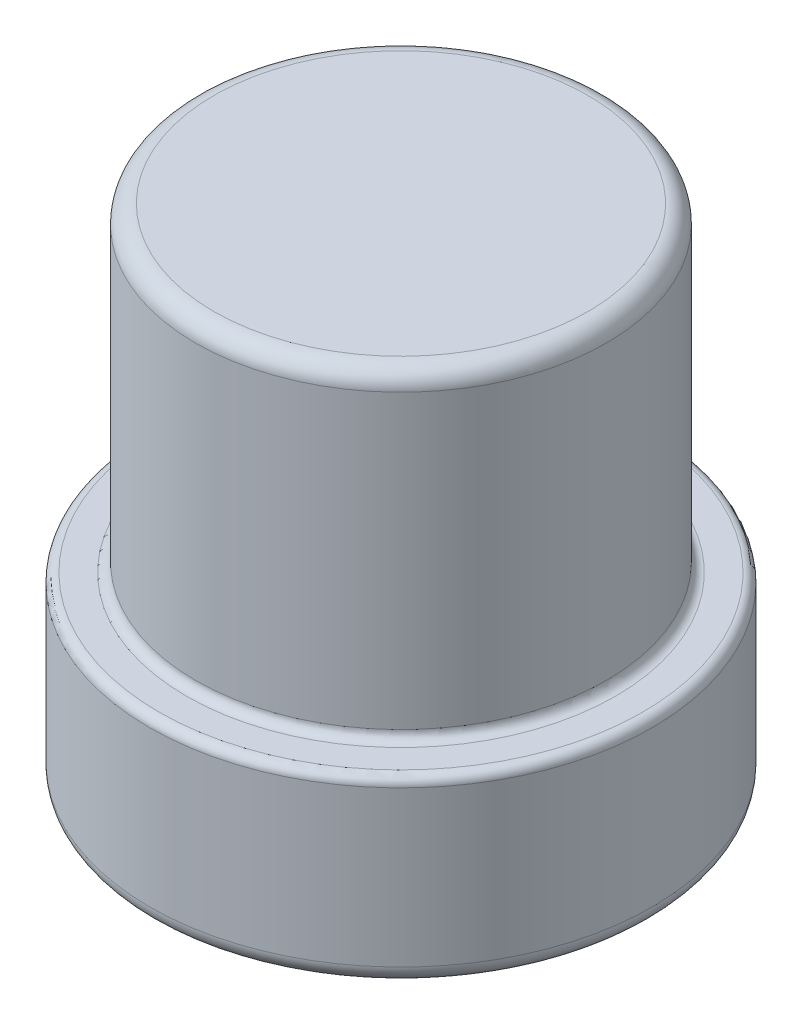
ISO-10303-21;
HEADER;
FILE_DESCRIPTION(('STEP AP214'),'2;1');
FILE_NAME('part.step','',(''),(''),'','','');
FILE_SCHEMA(('AUTOMOTIVE_DESIGN { 1 0 10303 214 1 1 1 1 }'));
ENDSEC;
DATA;
#1=APPLICATION_CONTEXT('core data for automotive mechanical design processes');
#2=APPLICATION_PROTOCOL_DEFINITION('international standard','automotive_design',2000,#1);
#3=PRODUCT_CONTEXT('',#1,'mechanical');
#4=PRODUCT('Part','Part','',(#3));
#5=PRODUCT_RELATED_PRODUCT_CATEGORY('part','',(#4));
#6=PRODUCT_DEFINITION_FORMATION('','',#4);
#7=PRODUCT_DEFINITION_CONTEXT('part definition',#1,'design');
#8=PRODUCT_DEFINITION('design','',#6,#7);
#9=PRODUCT_DEFINITION_SHAPE('','',#8);
#10=(LENGTH_UNIT() NAMED_UNIT(*) SI_UNIT(.MILLI.,.METRE.));
#11=(NAMED_UNIT(*) PLANE_ANGLE_UNIT() SI_UNIT($,.RADIAN.));
#12=(NAMED_UNIT(*) SI_UNIT($,.STERADIAN.) SOLID_ANGLE_UNIT());
#13=UNCERTAINTY_MEASURE_WITH_UNIT(LENGTH_MEASURE(1.E-05),#10,'distance_accuracy_value','');
#14=(GEOMETRIC_REPRESENTATION_CONTEXT(3) GLOBAL_UNCERTAINTY_ASSIGNED_CONTEXT((#13)) GLOBAL_UNIT_ASSIGNED_CONTEXT((#10,
#11,#12)) REPRESENTATION_CONTEXT('',''));
#15=CARTESIAN_POINT('',(0.,0.,0.));
#16=DIRECTION('',(0.,0.,1.));
#17=DIRECTION('',(1.,0.,0.));
#18=AXIS2_PLACEMENT_3D('',#15,#16,#17);
#19=CARTESIAN_POINT('',(0.,4.,0.));
#20=DIRECTION('',(0.,-1.,0.));
#21=DIRECTION('',(0.,0.,-1.));
#22=AXIS2_PLACEMENT_3D('',#19,#20,#21);
#23=CYLINDRICAL_SURFACE('',#22,5.5);
#24=CARTESIAN_POINT('',(0.,3.8,0.));
#25=DIRECTION('',(0.,1.,0.));
#26=DIRECTION('',(0.,0.,1.));
#27=AXIS2_PLACEMENT_3D('',#24,#25,#26);
#28=CIRCLE('',#27,5.5);
#29=CARTESIAN_POINT('',(0.,3.8,5.5));
#30=VERTEX_POINT('',#29);
#31=EDGE_CURVE('E44',#30,#30,#28,.F.);
#32=ORIENTED_EDGE('',*,*,#31,.T.);
#33=EDGE_LOOP('',(#32));
#34=FACE_BOUND('',#33,.T.);
#35=CARTESIAN_POINT('',(0.,0.4,0.));
#36=DIRECTION('',(0.,1.,0.));
#37=DIRECTION('',(0.,0.,1.));
#38=AXIS2_PLACEMENT_3D('',#35,#36,#37);
#39=CIRCLE('',#38,5.5);
#40=CARTESIAN_POINT('',(0.,0.4,5.5));
#41=VERTEX_POINT('',#40);
#42=EDGE_CURVE('E72',#41,#41,#39,.T.);
#43=ORIENTED_EDGE('',*,*,#42,.T.);
#44=EDGE_LOOP('',(#43));
#45=FACE_BOUND('',#44,.T.);
#46=ADVANCED_FACE('F37',(#34,#45),#23,.T.);
#47=CARTESIAN_POINT('',(0.,4.,0.));
#48=DIRECTION('',(0.,1.,0.));
#49=DIRECTION('',(0.,0.,1.));
#50=AXIS2_PLACEMENT_3D('',#47,#48,#49);
#51=PLANE('',#50);
#52=CARTESIAN_POINT('',(0.,4.,0.));
#53=DIRECTION('',(0.,1.,0.));
#54=DIRECTION('',(0.,0.,1.));
#55=AXIS2_PLACEMENT_3D('',#52,#53,#54);
#56=CIRCLE('',#55,5.3);
#57=CARTESIAN_POINT('',(0.,4.,5.3));
#58=VERTEX_POINT('',#57);
#59=EDGE_CURVE('E48',#58,#58,#56,.T.);
#60=ORIENTED_EDGE('',*,*,#59,.T.);
#61=EDGE_LOOP('',(#60));
#62=FACE_BOUND('',#61,.T.);
#63=CARTESIAN_POINT('',(0.,4.,0.));
#64=DIRECTION('',(0.,1.,0.));
#65=DIRECTION('',(0.,0.,1.));
#66=AXIS2_PLACEMENT_3D('',#63,#64,#65);
#67=CIRCLE('',#66,4.7);
#68=CARTESIAN_POINT('',(0.,4.,4.7));
#69=VERTEX_POINT('',#68);
#70=EDGE_CURVE('E52',#69,#69,#67,.F.);
#71=ORIENTED_EDGE('',*,*,#70,.T.);
#72=EDGE_LOOP('',(#71));
#73=FACE_BOUND('',#72,.T.);
#74=ADVANCED_FACE('F96',(#62,#73),#51,.T.);
#75=CARTESIAN_POINT('',(0.,0.,0.));
#76=DIRECTION('',(0.,1.,0.));
#77=DIRECTION('',(0.,0.,1.));
#78=AXIS2_PLACEMENT_3D('',#75,#76,#77);
#79=PLANE('',#78);
#80=CARTESIAN_POINT('',(0.,0.,0.));
#81=DIRECTION('',(0.,1.,0.));
#82=DIRECTION('',(0.,0.,1.));
#83=AXIS2_PLACEMENT_3D('',#80,#81,#82);
#84=CIRCLE('',#83,5.1);
#85=CARTESIAN_POINT('',(0.,0.,5.1));
#86=VERTEX_POINT('',#85);
#87=EDGE_CURVE('E66',#86,#86,#84,.F.);
#88=ORIENTED_EDGE('',*,*,#87,.T.);
#89=EDGE_LOOP('',(#88));
#90=FACE_BOUND('',#89,.T.);
#91=CARTESIAN_POINT('',(0.,0.,0.));
#92=DIRECTION('',(0.,1.,0.));
#93=DIRECTION('',(0.,0.,1.));
#94=AXIS2_PLACEMENT_3D('',#91,#92,#93);
#95=CIRCLE('',#94,3.9);
#96=CARTESIAN_POINT('',(0.,0.,3.9));
#97=VERTEX_POINT('',#96);
#98=EDGE_CURVE('E69',#97,#97,#95,.T.);
#99=ORIENTED_EDGE('',*,*,#98,.T.);
#100=EDGE_LOOP('',(#99));
#101=FACE_BOUND('',#100,.T.);
#102=ADVANCED_FACE('F101',(#90,#101),#79,.F.);
#103=CARTESIAN_POINT('',(0.,11.,0.));
#104=DIRECTION('',(0.,-1.,0.));
#105=DIRECTION('',(0.,0.,-1.));
#106=AXIS2_PLACEMENT_3D('',#103,#104,#105);
#107=CYLINDRICAL_SURFACE('',#106,4.5);
#108=CARTESIAN_POINT('',(0.,4.2,0.));
#109=DIRECTION('',(0.,1.,0.));
#110=DIRECTION('',(0.,0.,1.));
#111=AXIS2_PLACEMENT_3D('',#108,#109,#110);
#112=CIRCLE('',#111,4.5);
#113=CARTESIAN_POINT('',(0.,4.2,4.5));
#114=VERTEX_POINT('',#113);
#115=EDGE_CURVE('E10',#114,#114,#112,.T.);
#116=ORIENTED_EDGE('',*,*,#115,.T.);
#117=EDGE_LOOP('',(#116));
#118=FACE_BOUND('',#117,.T.);
#119=CARTESIAN_POINT('',(0.,10.6,0.));
#120=DIRECTION('',(0.,1.,0.));
#121=DIRECTION('',(0.,0.,1.));
#122=AXIS2_PLACEMENT_3D('',#119,#120,#121);
#123=CIRCLE('',#122,4.5);
#124=CARTESIAN_POINT('',(0.,10.6,4.5));
#125=VERTEX_POINT('',#124);
#126=EDGE_CURVE('E57',#125,#125,#123,.F.);
#127=ORIENTED_EDGE('',*,*,#126,.T.);
#128=EDGE_LOOP('',(#127));
#129=FACE_BOUND('',#128,.T.);
#130=ADVANCED_FACE('F92',(#118,#129),#107,.T.);
#131=CARTESIAN_POINT('',(0.,11.,0.));
#132=DIRECTION('',(0.,1.,0.));
#133=DIRECTION('',(0.,0.,1.));
#134=AXIS2_PLACEMENT_3D('',#131,#132,#133);
#135=PLANE('',#134);
#136=CARTESIAN_POINT('',(0.,11.,0.));
#137=DIRECTION('',(0.,1.,0.));
#138=DIRECTION('',(0.,0.,1.));
#139=AXIS2_PLACEMENT_3D('',#136,#137,#138);
#140=CIRCLE('',#139,4.1);
#141=CARTESIAN_POINT('',(0.,11.,4.1));
#142=VERTEX_POINT('',#141);
#143=EDGE_CURVE('E60',#142,#142,#140,.T.);
#144=ORIENTED_EDGE('',*,*,#143,.T.);
#145=EDGE_LOOP('',(#144));
#146=FACE_BOUND('',#145,.T.);
#147=ADVANCED_FACE('F83',(#146),#135,.T.);
#148=CARTESIAN_POINT('',(0.,4.5,0.));
#149=DIRECTION('',(0.,-1.,0.));
#150=DIRECTION('',(0.,0.,-1.));
#151=AXIS2_PLACEMENT_3D('',#148,#149,#150);
#152=CYLINDRICAL_SURFACE('',#151,3.5);
#153=CARTESIAN_POINT('',(0.,0.4,0.));
#154=DIRECTION('',(0.,1.,0.));
#155=DIRECTION('',(0.,0.,1.));
#156=AXIS2_PLACEMENT_3D('',#153,#154,#155);
#157=CIRCLE('',#156,3.5);
#158=CARTESIAN_POINT('',(0.,0.4,3.5));
#159=VERTEX_POINT('',#158);
#160=EDGE_CURVE('E63',#159,#159,#157,.F.);
#161=ORIENTED_EDGE('',*,*,#160,.T.);
#162=EDGE_LOOP('',(#161));
#163=FACE_BOUND('',#162,.T.);
#164=CARTESIAN_POINT('',(0.,4.5,0.));
#165=DIRECTION('',(0.,-1.,0.));
#166=DIRECTION('',(0.,0.,-1.));
#167=AXIS2_PLACEMENT_3D('',#164,#165,#166);
#168=CIRCLE('',#167,3.5);
#169=CARTESIAN_POINT('',(0.,4.5,-3.5));
#170=VERTEX_POINT('',#169);
#171=EDGE_CURVE('E75',#170,#170,#168,.T.);
#172=ORIENTED_EDGE('',*,*,#171,.F.);
#173=EDGE_LOOP('',(#172));
#174=FACE_BOUND('',#173,.T.);
#175=ADVANCED_FACE('F81',(#163,#174),#152,.F.);
#176=CARTESIAN_POINT('',(0.,4.5,0.));
#177=DIRECTION('',(0.,-1.,0.));
#178=DIRECTION('',(0.,0.,-1.));
#179=AXIS2_PLACEMENT_3D('',#176,#177,#178);
#180=PLANE('',#179);
#181=ORIENTED_EDGE('',*,*,#171,.T.);
#182=EDGE_LOOP('',(#181));
#183=FACE_BOUND('',#182,.T.);
#184=ADVANCED_FACE('F79',(#183),#180,.T.);
#185=CARTESIAN_POINT('',(0.,0.4,0.));
#186=DIRECTION('',(0.,1.,0.));
#187=DIRECTION('',(0.,0.,1.));
#188=AXIS2_PLACEMENT_3D('',#185,#186,#187);
#189=TOROIDAL_SURFACE('',#188,5.1,0.4);
#190=ORIENTED_EDGE('',*,*,#87,.F.);
#191=EDGE_LOOP('',(#190));
#192=FACE_BOUND('',#191,.T.);
#193=ORIENTED_EDGE('',*,*,#42,.F.);
#194=EDGE_LOOP('',(#193));
#195=FACE_BOUND('',#194,.T.);
#196=ADVANCED_FACE('F90',(#192,#195),#189,.T.);
#197=CARTESIAN_POINT('',(0.,0.4,0.));
#198=DIRECTION('',(0.,1.,0.));
#199=DIRECTION('',(0.,0.,1.));
#200=AXIS2_PLACEMENT_3D('',#197,#198,#199);
#201=TOROIDAL_SURFACE('',#200,3.9,0.4);
#202=ORIENTED_EDGE('',*,*,#98,.F.);
#203=EDGE_LOOP('',(#202));
#204=FACE_BOUND('',#203,.T.);
#205=ORIENTED_EDGE('',*,*,#160,.F.);
#206=EDGE_LOOP('',(#205));
#207=FACE_BOUND('',#206,.T.);
#208=ADVANCED_FACE('F109',(#204,#207),#201,.T.);
#209=CARTESIAN_POINT('',(0.,10.6,0.));
#210=DIRECTION('',(0.,1.,0.));
#211=DIRECTION('',(0.,0.,1.));
#212=AXIS2_PLACEMENT_3D('',#209,#210,#211);
#213=TOROIDAL_SURFACE('',#212,4.1,0.4);
#214=ORIENTED_EDGE('',*,*,#126,.F.);
#215=EDGE_LOOP('',(#214));
#216=FACE_BOUND('',#215,.T.);
#217=ORIENTED_EDGE('',*,*,#143,.F.);
#218=EDGE_LOOP('',(#217));
#219=FACE_BOUND('',#218,.T.);
#220=ADVANCED_FACE('F113',(#216,#219),#213,.T.);
#221=CARTESIAN_POINT('',(0.,3.8,0.));
#222=DIRECTION('',(0.,1.,0.));
#223=DIRECTION('',(0.,0.,1.));
#224=AXIS2_PLACEMENT_3D('',#221,#222,#223);
#225=TOROIDAL_SURFACE('',#224,5.3,0.2);
#226=ORIENTED_EDGE('',*,*,#31,.F.);
#227=EDGE_LOOP('',(#226));
#228=FACE_BOUND('',#227,.T.);
#229=ORIENTED_EDGE('',*,*,#59,.F.);
#230=EDGE_LOOP('',(#229));
#231=FACE_BOUND('',#230,.T.);
#232=ADVANCED_FACE('F116',(#228,#231),#225,.T.);
#233=CARTESIAN_POINT('',(0.,4.2,0.));
#234=DIRECTION('',(0.,1.,0.));
#235=DIRECTION('',(0.,0.,1.));
#236=AXIS2_PLACEMENT_3D('',#233,#234,#235);
#237=TOROIDAL_SURFACE('',#236,4.7,0.2);
#238=ORIENTED_EDGE('',*,*,#70,.F.);
#239=EDGE_LOOP('',(#238));
#240=FACE_BOUND('',#239,.T.);
#241=ORIENTED_EDGE('',*,*,#115,.F.);
#242=EDGE_LOOP('',(#241));
#243=FACE_BOUND('',#242,.T.);
#244=ADVANCED_FACE('F39',(#240,#243),#237,.F.);
#245=CLOSED_SHELL('',(#46,#74,#102,#130,#147,#175,#184,#196,#208,#220,#232,#244));
#246=MANIFOLD_SOLID_BREP('B2',#245);
#247=ADVANCED_BREP_SHAPE_REPRESENTATION('',(#18,#246),#14);
#248=SHAPE_DEFINITION_REPRESENTATION(#9,#247);
ENDSEC;
END-ISO-10303-21;
